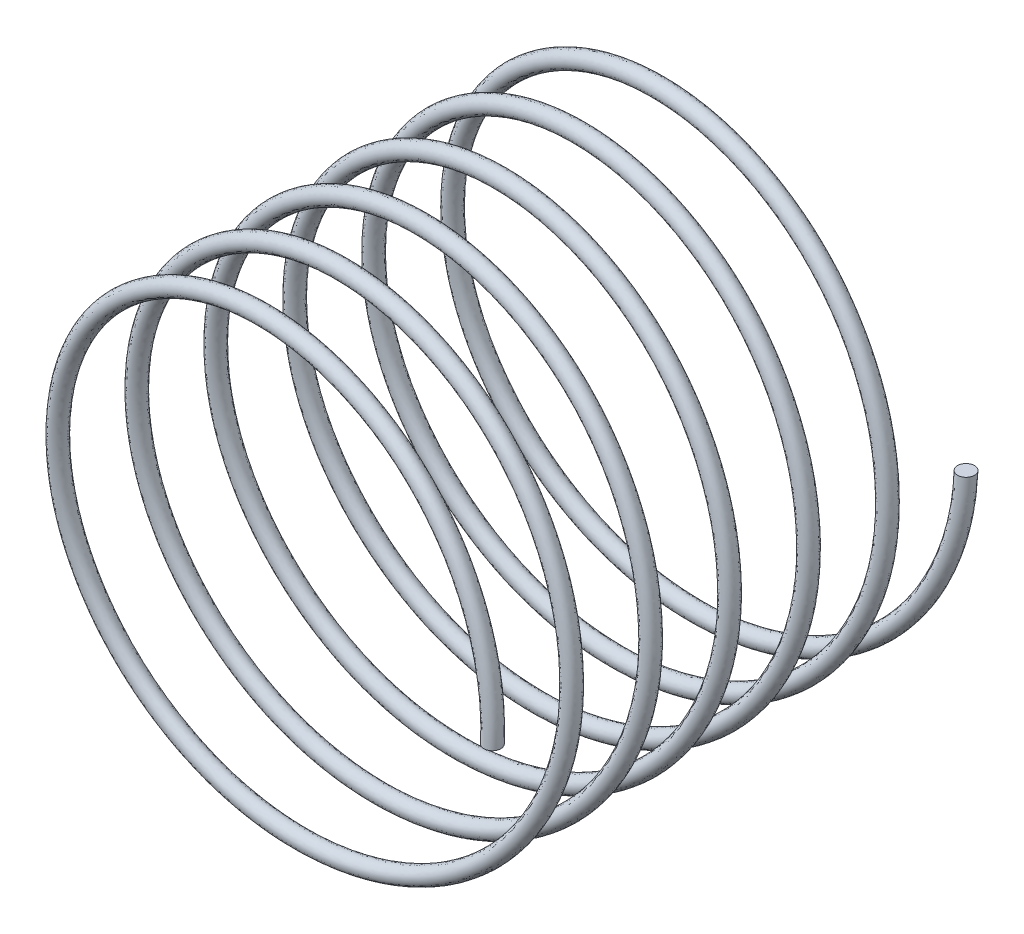
ISO-10303-21;
HEADER;
FILE_DESCRIPTION(('STEP AP214'),'2;1');
FILE_NAME('part.step','',(''),(''),'','','');
FILE_SCHEMA(('AUTOMOTIVE_DESIGN { 1 0 10303 214 1 1 1 1 }'));
ENDSEC;
DATA;
#1=APPLICATION_CONTEXT('core data for automotive mechanical design processes');
#2=APPLICATION_PROTOCOL_DEFINITION('international standard','automotive_design',2000,#1);
#3=PRODUCT_CONTEXT('',#1,'mechanical');
#4=PRODUCT('Part','Part','',(#3));
#5=PRODUCT_RELATED_PRODUCT_CATEGORY('part','',(#4));
#6=PRODUCT_DEFINITION_FORMATION('','',#4);
#7=PRODUCT_DEFINITION_CONTEXT('part definition',#1,'design');
#8=PRODUCT_DEFINITION('design','',#6,#7);
#9=PRODUCT_DEFINITION_SHAPE('','',#8);
#10=(LENGTH_UNIT() NAMED_UNIT(*) SI_UNIT(.MILLI.,.METRE.));
#11=(NAMED_UNIT(*) PLANE_ANGLE_UNIT() SI_UNIT($,.RADIAN.));
#12=(NAMED_UNIT(*) SI_UNIT($,.STERADIAN.) SOLID_ANGLE_UNIT());
#13=UNCERTAINTY_MEASURE_WITH_UNIT(LENGTH_MEASURE(1.E-05),#10,'distance_accuracy_value','');
#14=(GEOMETRIC_REPRESENTATION_CONTEXT(3) GLOBAL_UNCERTAINTY_ASSIGNED_CONTEXT((#13)) GLOBAL_UNIT_ASSIGNED_CONTEXT((#10,
#11,#12)) REPRESENTATION_CONTEXT('',''));
#15=CARTESIAN_POINT('',(0.,0.,0.));
#16=DIRECTION('',(0.,0.,1.));
#17=DIRECTION('',(1.,0.,0.));
#18=AXIS2_PLACEMENT_3D('',#15,#16,#17);
#19=CARTESIAN_POINT('',(2.8,0.,0.));
#20=DIRECTION('',(0.,1.,0.));
#21=DIRECTION('',(0.,0.,1.));
#22=AXIS2_PLACEMENT_3D('',#19,#20,#21);
#23=PLANE('',#22);
#24=CARTESIAN_POINT('',(2.8,0.,0.));
#25=DIRECTION('',(0.,1.,0.));
#26=DIRECTION('',(0.,0.,1.));
#27=AXIS2_PLACEMENT_3D('',#24,#25,#26);
#28=CIRCLE('',#27,0.0999999999999999);
#29=CARTESIAN_POINT('',(2.8,0.,0.0999999999999999));
#30=VERTEX_POINT('',#29);
#31=EDGE_CURVE('E43',#30,#30,#28,.T.);
#32=ORIENTED_EDGE('',*,*,#31,.T.);
#33=EDGE_LOOP('',(#32));
#34=FACE_BOUND('',#33,.T.);
#35=ADVANCED_FACE('F36',(#34),#23,.T.);
#36=CARTESIAN_POINT('',(2.8,-2.14732485265268E-13,5.6));
#37=DIRECTION('',(0.,1.,0.));
#38=DIRECTION('',(0.,0.,1.));
#39=AXIS2_PLACEMENT_3D('',#36,#37,#38);
#40=PLANE('',#39);
#41=CARTESIAN_POINT('',(2.8,-2.14732485265268E-13,5.6));
#42=DIRECTION('',(0.,1.,0.));
#43=DIRECTION('',(0.,0.,1.));
#44=AXIS2_PLACEMENT_3D('',#41,#42,#43);
#45=CIRCLE('',#44,0.0999999999999999);
#46=CARTESIAN_POINT('',(2.8,-2.14732485265268E-13,5.7));
#47=VERTEX_POINT('',#46);
#48=EDGE_CURVE('E11',#47,#47,#45,.T.);
#49=ORIENTED_EDGE('',*,*,#48,.F.);
#50=EDGE_LOOP('',(#49));
#51=FACE_BOUND('',#50,.T.);
#52=ADVANCED_FACE('F52',(#51),#40,.F.);
#53=CARTESIAN_POINT('',(2.8,0.,0.0999999999999999));
#54=CARTESIAN_POINT('',(2.8,-1.61658075373095,0.177777777777777));
#55=CARTESIAN_POINT('',(1.4,-2.42487113059643,0.255555555555555));
#56=CARTESIAN_POINT('',(0.,-3.2331615074619,0.333333333333333));
#57=CARTESIAN_POINT('',(-1.4,-2.42487113059643,0.41111111111111));
#58=CARTESIAN_POINT('',(-2.8,-1.61658075373095,0.488888888888888));
#59=CARTESIAN_POINT('',(-2.8,0.,0.566666666666666));
#60=CARTESIAN_POINT('',(-2.8,1.61658075373095,0.644444444444443));
#61=CARTESIAN_POINT('',(-1.4,2.42487113059643,0.722222222222221));
#62=CARTESIAN_POINT('',(0.,3.2331615074619,0.799999999999998));
#63=CARTESIAN_POINT('',(1.4,2.42487113059643,0.877777777777776));
#64=CARTESIAN_POINT('',(2.8,1.61658075373095,0.955555555555554));
#65=CARTESIAN_POINT('',(2.8,0.,1.03333333333333));
#66=CARTESIAN_POINT('',(2.8,-1.61658075373095,1.11111111111111));
#67=CARTESIAN_POINT('',(1.4,-2.42487113059643,1.18888888888889));
#68=CARTESIAN_POINT('',(0.,-3.2331615074619,1.26666666666666));
#69=CARTESIAN_POINT('',(-1.4,-2.42487113059643,1.34444444444444));
#70=CARTESIAN_POINT('',(-2.8,-1.61658075373095,1.42222222222222));
#71=CARTESIAN_POINT('',(-2.8,0.,1.5));
#72=CARTESIAN_POINT('',(-2.8,1.61658075373095,1.57777777777777));
#73=CARTESIAN_POINT('',(-1.4,2.42487113059643,1.65555555555555));
#74=CARTESIAN_POINT('',(0.,3.2331615074619,1.73333333333333));
#75=CARTESIAN_POINT('',(1.4,2.42487113059643,1.81111111111111));
#76=CARTESIAN_POINT('',(2.8,1.61658075373095,1.88888888888889));
#77=CARTESIAN_POINT('',(2.8,0.,1.96666666666666));
#78=CARTESIAN_POINT('',(2.8,-1.61658075373095,2.04444444444444));
#79=CARTESIAN_POINT('',(1.4,-2.42487113059643,2.12222222222222));
#80=CARTESIAN_POINT('',(0.,-3.2331615074619,2.2));
#81=CARTESIAN_POINT('',(-1.4,-2.42487113059643,2.27777777777777));
#82=CARTESIAN_POINT('',(-2.8,-1.61658075373095,2.35555555555555));
#83=CARTESIAN_POINT('',(-2.8,0.,2.43333333333333));
#84=CARTESIAN_POINT('',(-2.8,1.61658075373095,2.51111111111111));
#85=CARTESIAN_POINT('',(-1.4,2.42487113059643,2.58888888888888));
#86=CARTESIAN_POINT('',(0.,3.2331615074619,2.66666666666666));
#87=CARTESIAN_POINT('',(1.4,2.42487113059643,2.74444444444444));
#88=CARTESIAN_POINT('',(2.8,1.61658075373095,2.82222222222222));
#89=CARTESIAN_POINT('',(2.8,0.,2.89999999999999));
#90=CARTESIAN_POINT('',(2.8,-1.61658075373095,2.97777777777777));
#91=CARTESIAN_POINT('',(1.4,-2.42487113059643,3.05555555555555));
#92=CARTESIAN_POINT('',(0.,-3.2331615074619,3.13333333333333));
#93=CARTESIAN_POINT('',(-1.4,-2.42487113059643,3.2111111111111));
#94=CARTESIAN_POINT('',(-2.8,-1.61658075373095,3.28888888888888));
#95=CARTESIAN_POINT('',(-2.8,0.,3.36666666666666));
#96=CARTESIAN_POINT('',(-2.8,1.61658075373095,3.44444444444444));
#97=CARTESIAN_POINT('',(-1.4,2.42487113059643,3.52222222222222));
#98=CARTESIAN_POINT('',(0.,3.2331615074619,3.59999999999999));
#99=CARTESIAN_POINT('',(1.4,2.42487113059643,3.67777777777777));
#100=CARTESIAN_POINT('',(2.8,1.61658075373095,3.75555555555555));
#101=CARTESIAN_POINT('',(2.8,0.,3.83333333333333));
#102=CARTESIAN_POINT('',(2.8,-1.61658075373095,3.9111111111111));
#103=CARTESIAN_POINT('',(1.4,-2.42487113059643,3.98888888888888));
#104=CARTESIAN_POINT('',(0.,-3.2331615074619,4.06666666666666));
#105=CARTESIAN_POINT('',(-1.4,-2.42487113059643,4.14444444444444));
#106=CARTESIAN_POINT('',(-2.8,-1.61658075373095,4.22222222222221));
#107=CARTESIAN_POINT('',(-2.8,0.,4.29999999999999));
#108=CARTESIAN_POINT('',(-2.8,1.61658075373095,4.37777777777777));
#109=CARTESIAN_POINT('',(-1.4,2.42487113059643,4.45555555555555));
#110=CARTESIAN_POINT('',(0.,3.2331615074619,4.53333333333332));
#111=CARTESIAN_POINT('',(1.4,2.42487113059643,4.6111111111111));
#112=CARTESIAN_POINT('',(2.8,1.61658075373095,4.68888888888888));
#113=CARTESIAN_POINT('',(2.8,0.,4.76666666666666));
#114=CARTESIAN_POINT('',(2.8,-1.61658075373095,4.84444444444444));
#115=CARTESIAN_POINT('',(1.4,-2.42487113059643,4.92222222222221));
#116=CARTESIAN_POINT('',(0.,-3.2331615074619,4.99999999999999));
#117=CARTESIAN_POINT('',(-1.4,-2.42487113059643,5.07777777777777));
#118=CARTESIAN_POINT('',(-2.8,-1.61658075373095,5.15555555555555));
#119=CARTESIAN_POINT('',(-2.8,0.,5.23333333333332));
#120=CARTESIAN_POINT('',(-2.8,1.61658075373095,5.3111111111111));
#121=CARTESIAN_POINT('',(-1.4,2.42487113059643,5.38888888888888));
#122=CARTESIAN_POINT('',(0.,3.2331615074619,5.46666666666666));
#123=CARTESIAN_POINT('',(1.4,2.42487113059643,5.54444444444443));
#124=CARTESIAN_POINT('',(2.8,1.61658075373095,5.62222222222221));
#125=CARTESIAN_POINT('',(2.8,0.,5.69999999999999));
#126=CARTESIAN_POINT('',(3.,0.,0.0999999999999999));
#127=CARTESIAN_POINT('',(3.,-1.73205080756888,0.177777777777778));
#128=CARTESIAN_POINT('',(1.5,-2.59807621135332,0.255555555555555));
#129=CARTESIAN_POINT('',(0.,-3.46410161513775,0.333333333333333));
#130=CARTESIAN_POINT('',(-1.5,-2.59807621135332,0.41111111111111));
#131=CARTESIAN_POINT('',(-3.,-1.73205080756888,0.488888888888888));
#132=CARTESIAN_POINT('',(-3.,0.,0.566666666666666));
#133=CARTESIAN_POINT('',(-3.,1.73205080756888,0.644444444444443));
#134=CARTESIAN_POINT('',(-1.5,2.59807621135332,0.722222222222221));
#135=CARTESIAN_POINT('',(0.,3.46410161513775,0.799999999999998));
#136=CARTESIAN_POINT('',(1.5,2.59807621135332,0.877777777777776));
#137=CARTESIAN_POINT('',(3.,1.73205080756888,0.955555555555554));
#138=CARTESIAN_POINT('',(3.,0.,1.03333333333333));
#139=CARTESIAN_POINT('',(3.,-1.73205080756888,1.11111111111111));
#140=CARTESIAN_POINT('',(1.5,-2.59807621135332,1.18888888888889));
#141=CARTESIAN_POINT('',(0.,-3.46410161513775,1.26666666666666));
#142=CARTESIAN_POINT('',(-1.5,-2.59807621135332,1.34444444444444));
#143=CARTESIAN_POINT('',(-3.,-1.73205080756888,1.42222222222222));
#144=CARTESIAN_POINT('',(-3.,0.,1.5));
#145=CARTESIAN_POINT('',(-3.,1.73205080756888,1.57777777777777));
#146=CARTESIAN_POINT('',(-1.5,2.59807621135332,1.65555555555555));
#147=CARTESIAN_POINT('',(0.,3.46410161513775,1.73333333333333));
#148=CARTESIAN_POINT('',(1.5,2.59807621135332,1.81111111111111));
#149=CARTESIAN_POINT('',(3.,1.73205080756888,1.88888888888889));
#150=CARTESIAN_POINT('',(3.,0.,1.96666666666666));
#151=CARTESIAN_POINT('',(3.,-1.73205080756888,2.04444444444444));
#152=CARTESIAN_POINT('',(1.5,-2.59807621135332,2.12222222222222));
#153=CARTESIAN_POINT('',(0.,-3.46410161513775,2.2));
#154=CARTESIAN_POINT('',(-1.5,-2.59807621135332,2.27777777777777));
#155=CARTESIAN_POINT('',(-3.,-1.73205080756888,2.35555555555555));
#156=CARTESIAN_POINT('',(-3.,0.,2.43333333333333));
#157=CARTESIAN_POINT('',(-3.,1.73205080756888,2.51111111111111));
#158=CARTESIAN_POINT('',(-1.5,2.59807621135332,2.58888888888888));
#159=CARTESIAN_POINT('',(0.,3.46410161513775,2.66666666666666));
#160=CARTESIAN_POINT('',(1.5,2.59807621135332,2.74444444444444));
#161=CARTESIAN_POINT('',(3.,1.73205080756888,2.82222222222222));
#162=CARTESIAN_POINT('',(3.,0.,2.89999999999999));
#163=CARTESIAN_POINT('',(3.,-1.73205080756888,2.97777777777777));
#164=CARTESIAN_POINT('',(1.5,-2.59807621135332,3.05555555555555));
#165=CARTESIAN_POINT('',(0.,-3.46410161513775,3.13333333333333));
#166=CARTESIAN_POINT('',(-1.5,-2.59807621135332,3.21111111111111));
#167=CARTESIAN_POINT('',(-3.,-1.73205080756888,3.28888888888888));
#168=CARTESIAN_POINT('',(-3.,0.,3.36666666666666));
#169=CARTESIAN_POINT('',(-3.,1.73205080756888,3.44444444444444));
#170=CARTESIAN_POINT('',(-1.5,2.59807621135332,3.52222222222222));
#171=CARTESIAN_POINT('',(0.,3.46410161513775,3.59999999999999));
#172=CARTESIAN_POINT('',(1.5,2.59807621135332,3.67777777777777));
#173=CARTESIAN_POINT('',(3.,1.73205080756888,3.75555555555555));
#174=CARTESIAN_POINT('',(3.,0.,3.83333333333333));
#175=CARTESIAN_POINT('',(3.,-1.73205080756888,3.9111111111111));
#176=CARTESIAN_POINT('',(1.5,-2.59807621135332,3.98888888888888));
#177=CARTESIAN_POINT('',(0.,-3.46410161513775,4.06666666666666));
#178=CARTESIAN_POINT('',(-1.5,-2.59807621135332,4.14444444444444));
#179=CARTESIAN_POINT('',(-3.,-1.73205080756888,4.22222222222221));
#180=CARTESIAN_POINT('',(-3.,0.,4.29999999999999));
#181=CARTESIAN_POINT('',(-3.,1.73205080756888,4.37777777777777));
#182=CARTESIAN_POINT('',(-1.5,2.59807621135332,4.45555555555555));
#183=CARTESIAN_POINT('',(0.,3.46410161513775,4.53333333333332));
#184=CARTESIAN_POINT('',(1.5,2.59807621135332,4.6111111111111));
#185=CARTESIAN_POINT('',(3.,1.73205080756888,4.68888888888888));
#186=CARTESIAN_POINT('',(3.,0.,4.76666666666666));
#187=CARTESIAN_POINT('',(3.,-1.73205080756888,4.84444444444444));
#188=CARTESIAN_POINT('',(1.5,-2.59807621135332,4.92222222222221));
#189=CARTESIAN_POINT('',(0.,-3.46410161513775,4.99999999999999));
#190=CARTESIAN_POINT('',(-1.5,-2.59807621135332,5.07777777777777));
#191=CARTESIAN_POINT('',(-3.,-1.73205080756888,5.15555555555555));
#192=CARTESIAN_POINT('',(-3.,0.,5.23333333333332));
#193=CARTESIAN_POINT('',(-3.,1.73205080756888,5.3111111111111));
#194=CARTESIAN_POINT('',(-1.5,2.59807621135332,5.38888888888888));
#195=CARTESIAN_POINT('',(0.,3.46410161513775,5.46666666666666));
#196=CARTESIAN_POINT('',(1.5,2.59807621135332,5.54444444444443));
#197=CARTESIAN_POINT('',(3.,1.73205080756888,5.62222222222221));
#198=CARTESIAN_POINT('',(3.,0.,5.69999999999999));
#199=CARTESIAN_POINT('',(3.,0.,-0.0999999999999999));
#200=CARTESIAN_POINT('',(3.,-1.73205080756888,-0.0222222222222222));
#201=CARTESIAN_POINT('',(1.5,-2.59807621135332,0.0555555555555554));
#202=CARTESIAN_POINT('',(0.,-3.46410161513775,0.133333333333333));
#203=CARTESIAN_POINT('',(-1.5,-2.59807621135332,0.211111111111111));
#204=CARTESIAN_POINT('',(-3.,-1.73205080756888,0.288888888888888));
#205=CARTESIAN_POINT('',(-3.,0.,0.366666666666666));
#206=CARTESIAN_POINT('',(-3.,1.73205080756888,0.444444444444443));
#207=CARTESIAN_POINT('',(-1.5,2.59807621135332,0.522222222222221));
#208=CARTESIAN_POINT('',(0.,3.46410161513775,0.599999999999999));
#209=CARTESIAN_POINT('',(1.5,2.59807621135332,0.677777777777776));
#210=CARTESIAN_POINT('',(3.,1.73205080756888,0.755555555555554));
#211=CARTESIAN_POINT('',(3.,0.,0.833333333333332));
#212=CARTESIAN_POINT('',(3.,-1.73205080756888,0.911111111111109));
#213=CARTESIAN_POINT('',(1.5,-2.59807621135332,0.988888888888887));
#214=CARTESIAN_POINT('',(0.,-3.46410161513775,1.06666666666666));
#215=CARTESIAN_POINT('',(-1.5,-2.59807621135332,1.14444444444444));
#216=CARTESIAN_POINT('',(-3.,-1.73205080756888,1.22222222222222));
#217=CARTESIAN_POINT('',(-3.,0.,1.3));
#218=CARTESIAN_POINT('',(-3.,1.73205080756888,1.37777777777777));
#219=CARTESIAN_POINT('',(-1.5,2.59807621135332,1.45555555555555));
#220=CARTESIAN_POINT('',(0.,3.46410161513775,1.53333333333333));
#221=CARTESIAN_POINT('',(1.5,2.59807621135332,1.61111111111111));
#222=CARTESIAN_POINT('',(3.,1.73205080756888,1.68888888888889));
#223=CARTESIAN_POINT('',(3.,0.,1.76666666666666));
#224=CARTESIAN_POINT('',(3.,-1.73205080756888,1.84444444444444));
#225=CARTESIAN_POINT('',(1.5,-2.59807621135332,1.92222222222222));
#226=CARTESIAN_POINT('',(0.,-3.46410161513775,2.));
#227=CARTESIAN_POINT('',(-1.5,-2.59807621135332,2.07777777777777));
#228=CARTESIAN_POINT('',(-3.,-1.73205080756888,2.15555555555555));
#229=CARTESIAN_POINT('',(-3.,0.,2.23333333333333));
#230=CARTESIAN_POINT('',(-3.,1.73205080756888,2.31111111111111));
#231=CARTESIAN_POINT('',(-1.5,2.59807621135332,2.38888888888888));
#232=CARTESIAN_POINT('',(0.,3.46410161513775,2.46666666666666));
#233=CARTESIAN_POINT('',(1.5,2.59807621135332,2.54444444444444));
#234=CARTESIAN_POINT('',(3.,1.73205080756888,2.62222222222222));
#235=CARTESIAN_POINT('',(3.,0.,2.69999999999999));
#236=CARTESIAN_POINT('',(3.,-1.73205080756888,2.77777777777777));
#237=CARTESIAN_POINT('',(1.5,-2.59807621135332,2.85555555555555));
#238=CARTESIAN_POINT('',(0.,-3.46410161513775,2.93333333333333));
#239=CARTESIAN_POINT('',(-1.5,-2.59807621135332,3.0111111111111));
#240=CARTESIAN_POINT('',(-3.,-1.73205080756888,3.08888888888888));
#241=CARTESIAN_POINT('',(-3.,0.,3.16666666666666));
#242=CARTESIAN_POINT('',(-3.,1.73205080756888,3.24444444444444));
#243=CARTESIAN_POINT('',(-1.5,2.59807621135332,3.32222222222222));
#244=CARTESIAN_POINT('',(0.,3.46410161513775,3.39999999999999));
#245=CARTESIAN_POINT('',(1.5,2.59807621135332,3.47777777777777));
#246=CARTESIAN_POINT('',(3.,1.73205080756888,3.55555555555555));
#247=CARTESIAN_POINT('',(3.,0.,3.63333333333333));
#248=CARTESIAN_POINT('',(3.,-1.73205080756888,3.7111111111111));
#249=CARTESIAN_POINT('',(1.5,-2.59807621135332,3.78888888888888));
#250=CARTESIAN_POINT('',(0.,-3.46410161513775,3.86666666666666));
#251=CARTESIAN_POINT('',(-1.5,-2.59807621135332,3.94444444444444));
#252=CARTESIAN_POINT('',(-3.,-1.73205080756888,4.02222222222221));
#253=CARTESIAN_POINT('',(-3.,0.,4.09999999999999));
#254=CARTESIAN_POINT('',(-3.,1.73205080756888,4.17777777777777));
#255=CARTESIAN_POINT('',(-1.5,2.59807621135332,4.25555555555555));
#256=CARTESIAN_POINT('',(0.,3.46410161513775,4.33333333333332));
#257=CARTESIAN_POINT('',(1.5,2.59807621135332,4.4111111111111));
#258=CARTESIAN_POINT('',(3.,1.73205080756888,4.48888888888888));
#259=CARTESIAN_POINT('',(3.,0.,4.56666666666666));
#260=CARTESIAN_POINT('',(3.,-1.73205080756888,4.64444444444443));
#261=CARTESIAN_POINT('',(1.5,-2.59807621135332,4.72222222222221));
#262=CARTESIAN_POINT('',(0.,-3.46410161513775,4.79999999999999));
#263=CARTESIAN_POINT('',(-1.5,-2.59807621135332,4.87777777777777));
#264=CARTESIAN_POINT('',(-3.,-1.73205080756888,4.95555555555555));
#265=CARTESIAN_POINT('',(-3.,0.,5.03333333333332));
#266=CARTESIAN_POINT('',(-3.,1.73205080756888,5.1111111111111));
#267=CARTESIAN_POINT('',(-1.5,2.59807621135332,5.18888888888888));
#268=CARTESIAN_POINT('',(0.,3.46410161513775,5.26666666666666));
#269=CARTESIAN_POINT('',(1.5,2.59807621135332,5.34444444444443));
#270=CARTESIAN_POINT('',(3.,1.73205080756888,5.42222222222221));
#271=CARTESIAN_POINT('',(3.,0.,5.49999999999999));
#272=CARTESIAN_POINT('',(2.8,0.,-0.0999999999999999));
#273=CARTESIAN_POINT('',(2.8,-1.61658075373095,-0.0222222222222223));
#274=CARTESIAN_POINT('',(1.4,-2.42487113059643,0.0555555555555554));
#275=CARTESIAN_POINT('',(0.,-3.2331615074619,0.133333333333333));
#276=CARTESIAN_POINT('',(-1.4,-2.42487113059643,0.211111111111111));
#277=CARTESIAN_POINT('',(-2.8,-1.61658075373095,0.288888888888888));
#278=CARTESIAN_POINT('',(-2.8,0.,0.366666666666666));
#279=CARTESIAN_POINT('',(-2.8,1.61658075373095,0.444444444444443));
#280=CARTESIAN_POINT('',(-1.4,2.42487113059643,0.522222222222221));
#281=CARTESIAN_POINT('',(0.,3.2331615074619,0.599999999999999));
#282=CARTESIAN_POINT('',(1.4,2.42487113059643,0.677777777777776));
#283=CARTESIAN_POINT('',(2.8,1.61658075373095,0.755555555555554));
#284=CARTESIAN_POINT('',(2.8,0.,0.833333333333332));
#285=CARTESIAN_POINT('',(2.8,-1.61658075373095,0.911111111111109));
#286=CARTESIAN_POINT('',(1.4,-2.42487113059643,0.988888888888887));
#287=CARTESIAN_POINT('',(0.,-3.2331615074619,1.06666666666666));
#288=CARTESIAN_POINT('',(-1.4,-2.42487113059643,1.14444444444444));
#289=CARTESIAN_POINT('',(-2.8,-1.61658075373095,1.22222222222222));
#290=CARTESIAN_POINT('',(-2.8,0.,1.3));
#291=CARTESIAN_POINT('',(-2.8,1.61658075373095,1.37777777777777));
#292=CARTESIAN_POINT('',(-1.4,2.42487113059643,1.45555555555555));
#293=CARTESIAN_POINT('',(0.,3.2331615074619,1.53333333333333));
#294=CARTESIAN_POINT('',(1.4,2.42487113059643,1.61111111111111));
#295=CARTESIAN_POINT('',(2.8,1.61658075373095,1.68888888888889));
#296=CARTESIAN_POINT('',(2.8,0.,1.76666666666666));
#297=CARTESIAN_POINT('',(2.8,-1.61658075373095,1.84444444444444));
#298=CARTESIAN_POINT('',(1.4,-2.42487113059643,1.92222222222222));
#299=CARTESIAN_POINT('',(0.,-3.2331615074619,2.));
#300=CARTESIAN_POINT('',(-1.4,-2.42487113059643,2.07777777777777));
#301=CARTESIAN_POINT('',(-2.8,-1.61658075373095,2.15555555555555));
#302=CARTESIAN_POINT('',(-2.8,0.,2.23333333333333));
#303=CARTESIAN_POINT('',(-2.8,1.61658075373095,2.31111111111111));
#304=CARTESIAN_POINT('',(-1.4,2.42487113059643,2.38888888888888));
#305=CARTESIAN_POINT('',(0.,3.2331615074619,2.46666666666666));
#306=CARTESIAN_POINT('',(1.4,2.42487113059643,2.54444444444444));
#307=CARTESIAN_POINT('',(2.8,1.61658075373095,2.62222222222222));
#308=CARTESIAN_POINT('',(2.8,0.,2.69999999999999));
#309=CARTESIAN_POINT('',(2.8,-1.61658075373095,2.77777777777777));
#310=CARTESIAN_POINT('',(1.4,-2.42487113059643,2.85555555555555));
#311=CARTESIAN_POINT('',(0.,-3.2331615074619,2.93333333333333));
#312=CARTESIAN_POINT('',(-1.4,-2.42487113059643,3.0111111111111));
#313=CARTESIAN_POINT('',(-2.8,-1.61658075373095,3.08888888888888));
#314=CARTESIAN_POINT('',(-2.8,0.,3.16666666666666));
#315=CARTESIAN_POINT('',(-2.8,1.61658075373095,3.24444444444444));
#316=CARTESIAN_POINT('',(-1.4,2.42487113059643,3.32222222222222));
#317=CARTESIAN_POINT('',(0.,3.2331615074619,3.39999999999999));
#318=CARTESIAN_POINT('',(1.4,2.42487113059643,3.47777777777777));
#319=CARTESIAN_POINT('',(2.8,1.61658075373095,3.55555555555555));
#320=CARTESIAN_POINT('',(2.8,0.,3.63333333333333));
#321=CARTESIAN_POINT('',(2.8,-1.61658075373095,3.7111111111111));
#322=CARTESIAN_POINT('',(1.4,-2.42487113059643,3.78888888888888));
#323=CARTESIAN_POINT('',(0.,-3.2331615074619,3.86666666666666));
#324=CARTESIAN_POINT('',(-1.4,-2.42487113059643,3.94444444444444));
#325=CARTESIAN_POINT('',(-2.8,-1.61658075373095,4.02222222222221));
#326=CARTESIAN_POINT('',(-2.8,0.,4.09999999999999));
#327=CARTESIAN_POINT('',(-2.8,1.61658075373095,4.17777777777777));
#328=CARTESIAN_POINT('',(-1.4,2.42487113059643,4.25555555555555));
#329=CARTESIAN_POINT('',(0.,3.2331615074619,4.33333333333332));
#330=CARTESIAN_POINT('',(1.4,2.42487113059643,4.4111111111111));
#331=CARTESIAN_POINT('',(2.8,1.61658075373095,4.48888888888888));
#332=CARTESIAN_POINT('',(2.8,0.,4.56666666666666));
#333=CARTESIAN_POINT('',(2.8,-1.61658075373095,4.64444444444443));
#334=CARTESIAN_POINT('',(1.4,-2.42487113059643,4.72222222222221));
#335=CARTESIAN_POINT('',(0.,-3.2331615074619,4.79999999999999));
#336=CARTESIAN_POINT('',(-1.4,-2.42487113059643,4.87777777777777));
#337=CARTESIAN_POINT('',(-2.8,-1.61658075373095,4.95555555555555));
#338=CARTESIAN_POINT('',(-2.8,0.,5.03333333333332));
#339=CARTESIAN_POINT('',(-2.8,1.61658075373095,5.1111111111111));
#340=CARTESIAN_POINT('',(-1.4,2.42487113059643,5.18888888888888));
#341=CARTESIAN_POINT('',(0.,3.2331615074619,5.26666666666666));
#342=CARTESIAN_POINT('',(1.4,2.42487113059643,5.34444444444443));
#343=CARTESIAN_POINT('',(2.8,1.61658075373095,5.42222222222221));
#344=CARTESIAN_POINT('',(2.8,0.,5.49999999999999));
#345=CARTESIAN_POINT('',(2.6,0.,-0.0999999999999999));
#346=CARTESIAN_POINT('',(2.6,-1.50111069989303,-0.0222222222222223));
#347=CARTESIAN_POINT('',(1.3,-2.25166604983954,0.0555555555555553));
#348=CARTESIAN_POINT('',(0.,-3.00222139978605,0.133333333333333));
#349=CARTESIAN_POINT('',(-1.3,-2.25166604983954,0.211111111111111));
#350=CARTESIAN_POINT('',(-2.6,-1.50111069989303,0.288888888888888));
#351=CARTESIAN_POINT('',(-2.6,0.,0.366666666666666));
#352=CARTESIAN_POINT('',(-2.6,1.50111069989303,0.444444444444443));
#353=CARTESIAN_POINT('',(-1.3,2.25166604983954,0.522222222222221));
#354=CARTESIAN_POINT('',(0.,3.00222139978605,0.599999999999999));
#355=CARTESIAN_POINT('',(1.3,2.25166604983954,0.677777777777776));
#356=CARTESIAN_POINT('',(2.6,1.50111069989303,0.755555555555554));
#357=CARTESIAN_POINT('',(2.6,0.,0.833333333333331));
#358=CARTESIAN_POINT('',(2.6,-1.50111069989303,0.911111111111109));
#359=CARTESIAN_POINT('',(1.3,-2.25166604983954,0.988888888888887));
#360=CARTESIAN_POINT('',(0.,-3.00222139978605,1.06666666666666));
#361=CARTESIAN_POINT('',(-1.3,-2.25166604983954,1.14444444444444));
#362=CARTESIAN_POINT('',(-2.6,-1.50111069989303,1.22222222222222));
#363=CARTESIAN_POINT('',(-2.6,0.,1.3));
#364=CARTESIAN_POINT('',(-2.6,1.50111069989303,1.37777777777777));
#365=CARTESIAN_POINT('',(-1.3,2.25166604983954,1.45555555555555));
#366=CARTESIAN_POINT('',(0.,3.00222139978605,1.53333333333333));
#367=CARTESIAN_POINT('',(1.3,2.25166604983954,1.61111111111111));
#368=CARTESIAN_POINT('',(2.6,1.50111069989303,1.68888888888889));
#369=CARTESIAN_POINT('',(2.6,0.,1.76666666666666));
#370=CARTESIAN_POINT('',(2.6,-1.50111069989303,1.84444444444444));
#371=CARTESIAN_POINT('',(1.3,-2.25166604983954,1.92222222222222));
#372=CARTESIAN_POINT('',(0.,-3.00222139978605,2.));
#373=CARTESIAN_POINT('',(-1.3,-2.25166604983954,2.07777777777777));
#374=CARTESIAN_POINT('',(-2.6,-1.50111069989303,2.15555555555555));
#375=CARTESIAN_POINT('',(-2.6,0.,2.23333333333333));
#376=CARTESIAN_POINT('',(-2.6,1.50111069989303,2.31111111111111));
#377=CARTESIAN_POINT('',(-1.3,2.25166604983954,2.38888888888888));
#378=CARTESIAN_POINT('',(0.,3.00222139978605,2.46666666666666));
#379=CARTESIAN_POINT('',(1.3,2.25166604983954,2.54444444444444));
#380=CARTESIAN_POINT('',(2.6,1.50111069989303,2.62222222222222));
#381=CARTESIAN_POINT('',(2.6,0.,2.69999999999999));
#382=CARTESIAN_POINT('',(2.6,-1.50111069989303,2.77777777777777));
#383=CARTESIAN_POINT('',(1.3,-2.25166604983954,2.85555555555555));
#384=CARTESIAN_POINT('',(0.,-3.00222139978605,2.93333333333333));
#385=CARTESIAN_POINT('',(-1.3,-2.25166604983954,3.0111111111111));
#386=CARTESIAN_POINT('',(-2.6,-1.50111069989303,3.08888888888888));
#387=CARTESIAN_POINT('',(-2.6,0.,3.16666666666666));
#388=CARTESIAN_POINT('',(-2.6,1.50111069989303,3.24444444444444));
#389=CARTESIAN_POINT('',(-1.3,2.25166604983954,3.32222222222222));
#390=CARTESIAN_POINT('',(0.,3.00222139978605,3.39999999999999));
#391=CARTESIAN_POINT('',(1.3,2.25166604983954,3.47777777777777));
#392=CARTESIAN_POINT('',(2.6,1.50111069989303,3.55555555555555));
#393=CARTESIAN_POINT('',(2.6,0.,3.63333333333333));
#394=CARTESIAN_POINT('',(2.6,-1.50111069989303,3.7111111111111));
#395=CARTESIAN_POINT('',(1.3,-2.25166604983954,3.78888888888888));
#396=CARTESIAN_POINT('',(0.,-3.00222139978605,3.86666666666666));
#397=CARTESIAN_POINT('',(-1.3,-2.25166604983954,3.94444444444444));
#398=CARTESIAN_POINT('',(-2.6,-1.50111069989303,4.02222222222221));
#399=CARTESIAN_POINT('',(-2.6,0.,4.09999999999999));
#400=CARTESIAN_POINT('',(-2.6,1.50111069989303,4.17777777777777));
#401=CARTESIAN_POINT('',(-1.3,2.25166604983954,4.25555555555555));
#402=CARTESIAN_POINT('',(0.,3.00222139978605,4.33333333333332));
#403=CARTESIAN_POINT('',(1.3,2.25166604983954,4.4111111111111));
#404=CARTESIAN_POINT('',(2.6,1.50111069989303,4.48888888888888));
#405=CARTESIAN_POINT('',(2.6,0.,4.56666666666666));
#406=CARTESIAN_POINT('',(2.6,-1.50111069989303,4.64444444444443));
#407=CARTESIAN_POINT('',(1.3,-2.25166604983954,4.72222222222221));
#408=CARTESIAN_POINT('',(0.,-3.00222139978605,4.79999999999999));
#409=CARTESIAN_POINT('',(-1.3,-2.25166604983954,4.87777777777777));
#410=CARTESIAN_POINT('',(-2.6,-1.50111069989303,4.95555555555555));
#411=CARTESIAN_POINT('',(-2.6,0.,5.03333333333332));
#412=CARTESIAN_POINT('',(-2.6,1.50111069989303,5.1111111111111));
#413=CARTESIAN_POINT('',(-1.3,2.25166604983954,5.18888888888888));
#414=CARTESIAN_POINT('',(0.,3.00222139978605,5.26666666666666));
#415=CARTESIAN_POINT('',(1.3,2.25166604983954,5.34444444444443));
#416=CARTESIAN_POINT('',(2.6,1.50111069989303,5.42222222222221));
#417=CARTESIAN_POINT('',(2.6,0.,5.49999999999999));
#418=CARTESIAN_POINT('',(2.6,0.,0.0999999999999999));
#419=CARTESIAN_POINT('',(2.6,-1.50111069989303,0.177777777777778));
#420=CARTESIAN_POINT('',(1.3,-2.25166604983954,0.255555555555555));
#421=CARTESIAN_POINT('',(0.,-3.00222139978605,0.333333333333333));
#422=CARTESIAN_POINT('',(-1.3,-2.25166604983954,0.41111111111111));
#423=CARTESIAN_POINT('',(-2.6,-1.50111069989303,0.488888888888888));
#424=CARTESIAN_POINT('',(-2.6,0.,0.566666666666666));
#425=CARTESIAN_POINT('',(-2.6,1.50111069989303,0.644444444444443));
#426=CARTESIAN_POINT('',(-1.3,2.25166604983954,0.722222222222221));
#427=CARTESIAN_POINT('',(0.,3.00222139978605,0.799999999999998));
#428=CARTESIAN_POINT('',(1.3,2.25166604983954,0.877777777777776));
#429=CARTESIAN_POINT('',(2.6,1.50111069989303,0.955555555555554));
#430=CARTESIAN_POINT('',(2.6,0.,1.03333333333333));
#431=CARTESIAN_POINT('',(2.6,-1.50111069989303,1.11111111111111));
#432=CARTESIAN_POINT('',(1.3,-2.25166604983954,1.18888888888889));
#433=CARTESIAN_POINT('',(0.,-3.00222139978605,1.26666666666666));
#434=CARTESIAN_POINT('',(-1.3,-2.25166604983954,1.34444444444444));
#435=CARTESIAN_POINT('',(-2.6,-1.50111069989303,1.42222222222222));
#436=CARTESIAN_POINT('',(-2.6,0.,1.5));
#437=CARTESIAN_POINT('',(-2.6,1.50111069989303,1.57777777777777));
#438=CARTESIAN_POINT('',(-1.3,2.25166604983954,1.65555555555555));
#439=CARTESIAN_POINT('',(0.,3.00222139978605,1.73333333333333));
#440=CARTESIAN_POINT('',(1.3,2.25166604983954,1.81111111111111));
#441=CARTESIAN_POINT('',(2.6,1.50111069989303,1.88888888888889));
#442=CARTESIAN_POINT('',(2.6,0.,1.96666666666666));
#443=CARTESIAN_POINT('',(2.6,-1.50111069989303,2.04444444444444));
#444=CARTESIAN_POINT('',(1.3,-2.25166604983954,2.12222222222222));
#445=CARTESIAN_POINT('',(0.,-3.00222139978605,2.2));
#446=CARTESIAN_POINT('',(-1.3,-2.25166604983954,2.27777777777777));
#447=CARTESIAN_POINT('',(-2.6,-1.50111069989303,2.35555555555555));
#448=CARTESIAN_POINT('',(-2.6,0.,2.43333333333333));
#449=CARTESIAN_POINT('',(-2.6,1.50111069989303,2.51111111111111));
#450=CARTESIAN_POINT('',(-1.3,2.25166604983954,2.58888888888888));
#451=CARTESIAN_POINT('',(0.,3.00222139978605,2.66666666666666));
#452=CARTESIAN_POINT('',(1.3,2.25166604983954,2.74444444444444));
#453=CARTESIAN_POINT('',(2.6,1.50111069989303,2.82222222222222));
#454=CARTESIAN_POINT('',(2.6,0.,2.89999999999999));
#455=CARTESIAN_POINT('',(2.6,-1.50111069989303,2.97777777777777));
#456=CARTESIAN_POINT('',(1.3,-2.25166604983954,3.05555555555555));
#457=CARTESIAN_POINT('',(0.,-3.00222139978605,3.13333333333333));
#458=CARTESIAN_POINT('',(-1.3,-2.25166604983954,3.21111111111111));
#459=CARTESIAN_POINT('',(-2.6,-1.50111069989303,3.28888888888888));
#460=CARTESIAN_POINT('',(-2.6,0.,3.36666666666666));
#461=CARTESIAN_POINT('',(-2.6,1.50111069989303,3.44444444444444));
#462=CARTESIAN_POINT('',(-1.3,2.25166604983954,3.52222222222222));
#463=CARTESIAN_POINT('',(0.,3.00222139978605,3.59999999999999));
#464=CARTESIAN_POINT('',(1.3,2.25166604983954,3.67777777777777));
#465=CARTESIAN_POINT('',(2.6,1.50111069989303,3.75555555555555));
#466=CARTESIAN_POINT('',(2.6,0.,3.83333333333333));
#467=CARTESIAN_POINT('',(2.6,-1.50111069989303,3.9111111111111));
#468=CARTESIAN_POINT('',(1.3,-2.25166604983954,3.98888888888888));
#469=CARTESIAN_POINT('',(0.,-3.00222139978605,4.06666666666666));
#470=CARTESIAN_POINT('',(-1.3,-2.25166604983954,4.14444444444444));
#471=CARTESIAN_POINT('',(-2.6,-1.50111069989303,4.22222222222221));
#472=CARTESIAN_POINT('',(-2.6,0.,4.29999999999999));
#473=CARTESIAN_POINT('',(-2.6,1.50111069989303,4.37777777777777));
#474=CARTESIAN_POINT('',(-1.3,2.25166604983954,4.45555555555555));
#475=CARTESIAN_POINT('',(0.,3.00222139978605,4.53333333333332));
#476=CARTESIAN_POINT('',(1.3,2.25166604983954,4.6111111111111));
#477=CARTESIAN_POINT('',(2.6,1.50111069989303,4.68888888888888));
#478=CARTESIAN_POINT('',(2.6,0.,4.76666666666666));
#479=CARTESIAN_POINT('',(2.6,-1.50111069989303,4.84444444444444));
#480=CARTESIAN_POINT('',(1.3,-2.25166604983954,4.92222222222221));
#481=CARTESIAN_POINT('',(0.,-3.00222139978605,4.99999999999999));
#482=CARTESIAN_POINT('',(-1.3,-2.25166604983954,5.07777777777777));
#483=CARTESIAN_POINT('',(-2.6,-1.50111069989303,5.15555555555555));
#484=CARTESIAN_POINT('',(-2.6,0.,5.23333333333332));
#485=CARTESIAN_POINT('',(-2.6,1.50111069989303,5.3111111111111));
#486=CARTESIAN_POINT('',(-1.3,2.25166604983954,5.38888888888888));
#487=CARTESIAN_POINT('',(0.,3.00222139978605,5.46666666666666));
#488=CARTESIAN_POINT('',(1.3,2.25166604983954,5.54444444444443));
#489=CARTESIAN_POINT('',(2.6,1.50111069989303,5.62222222222221));
#490=CARTESIAN_POINT('',(2.6,0.,5.69999999999999));
#491=CARTESIAN_POINT('',(2.8,0.,0.0999999999999999));
#492=CARTESIAN_POINT('',(2.8,-1.61658075373095,0.177777777777777));
#493=CARTESIAN_POINT('',(1.4,-2.42487113059643,0.255555555555555));
#494=CARTESIAN_POINT('',(0.,-3.2331615074619,0.333333333333333));
#495=CARTESIAN_POINT('',(-1.4,-2.42487113059643,0.41111111111111));
#496=CARTESIAN_POINT('',(-2.8,-1.61658075373095,0.488888888888888));
#497=CARTESIAN_POINT('',(-2.8,0.,0.566666666666666));
#498=CARTESIAN_POINT('',(-2.8,1.61658075373095,0.644444444444443));
#499=CARTESIAN_POINT('',(-1.4,2.42487113059643,0.722222222222221));
#500=CARTESIAN_POINT('',(0.,3.2331615074619,0.799999999999998));
#501=CARTESIAN_POINT('',(1.4,2.42487113059643,0.877777777777776));
#502=CARTESIAN_POINT('',(2.8,1.61658075373095,0.955555555555554));
#503=CARTESIAN_POINT('',(2.8,0.,1.03333333333333));
#504=CARTESIAN_POINT('',(2.8,-1.61658075373095,1.11111111111111));
#505=CARTESIAN_POINT('',(1.4,-2.42487113059643,1.18888888888889));
#506=CARTESIAN_POINT('',(0.,-3.2331615074619,1.26666666666666));
#507=CARTESIAN_POINT('',(-1.4,-2.42487113059643,1.34444444444444));
#508=CARTESIAN_POINT('',(-2.8,-1.61658075373095,1.42222222222222));
#509=CARTESIAN_POINT('',(-2.8,0.,1.5));
#510=CARTESIAN_POINT('',(-2.8,1.61658075373095,1.57777777777777));
#511=CARTESIAN_POINT('',(-1.4,2.42487113059643,1.65555555555555));
#512=CARTESIAN_POINT('',(0.,3.2331615074619,1.73333333333333));
#513=CARTESIAN_POINT('',(1.4,2.42487113059643,1.81111111111111));
#514=CARTESIAN_POINT('',(2.8,1.61658075373095,1.88888888888889));
#515=CARTESIAN_POINT('',(2.8,0.,1.96666666666666));
#516=CARTESIAN_POINT('',(2.8,-1.61658075373095,2.04444444444444));
#517=CARTESIAN_POINT('',(1.4,-2.42487113059643,2.12222222222222));
#518=CARTESIAN_POINT('',(0.,-3.2331615074619,2.2));
#519=CARTESIAN_POINT('',(-1.4,-2.42487113059643,2.27777777777777));
#520=CARTESIAN_POINT('',(-2.8,-1.61658075373095,2.35555555555555));
#521=CARTESIAN_POINT('',(-2.8,0.,2.43333333333333));
#522=CARTESIAN_POINT('',(-2.8,1.61658075373095,2.51111111111111));
#523=CARTESIAN_POINT('',(-1.4,2.42487113059643,2.58888888888888));
#524=CARTESIAN_POINT('',(0.,3.2331615074619,2.66666666666666));
#525=CARTESIAN_POINT('',(1.4,2.42487113059643,2.74444444444444));
#526=CARTESIAN_POINT('',(2.8,1.61658075373095,2.82222222222222));
#527=CARTESIAN_POINT('',(2.8,0.,2.89999999999999));
#528=CARTESIAN_POINT('',(2.8,-1.61658075373095,2.97777777777777));
#529=CARTESIAN_POINT('',(1.4,-2.42487113059643,3.05555555555555));
#530=CARTESIAN_POINT('',(0.,-3.2331615074619,3.13333333333333));
#531=CARTESIAN_POINT('',(-1.4,-2.42487113059643,3.2111111111111));
#532=CARTESIAN_POINT('',(-2.8,-1.61658075373095,3.28888888888888));
#533=CARTESIAN_POINT('',(-2.8,0.,3.36666666666666));
#534=CARTESIAN_POINT('',(-2.8,1.61658075373095,3.44444444444444));
#535=CARTESIAN_POINT('',(-1.4,2.42487113059643,3.52222222222222));
#536=CARTESIAN_POINT('',(0.,3.2331615074619,3.59999999999999));
#537=CARTESIAN_POINT('',(1.4,2.42487113059643,3.67777777777777));
#538=CARTESIAN_POINT('',(2.8,1.61658075373095,3.75555555555555));
#539=CARTESIAN_POINT('',(2.8,0.,3.83333333333333));
#540=CARTESIAN_POINT('',(2.8,-1.61658075373095,3.9111111111111));
#541=CARTESIAN_POINT('',(1.4,-2.42487113059643,3.98888888888888));
#542=CARTESIAN_POINT('',(0.,-3.2331615074619,4.06666666666666));
#543=CARTESIAN_POINT('',(-1.4,-2.42487113059643,4.14444444444444));
#544=CARTESIAN_POINT('',(-2.8,-1.61658075373095,4.22222222222221));
#545=CARTESIAN_POINT('',(-2.8,0.,4.29999999999999));
#546=CARTESIAN_POINT('',(-2.8,1.61658075373095,4.37777777777777));
#547=CARTESIAN_POINT('',(-1.4,2.42487113059643,4.45555555555555));
#548=CARTESIAN_POINT('',(0.,3.2331615074619,4.53333333333332));
#549=CARTESIAN_POINT('',(1.4,2.42487113059643,4.6111111111111));
#550=CARTESIAN_POINT('',(2.8,1.61658075373095,4.68888888888888));
#551=CARTESIAN_POINT('',(2.8,0.,4.76666666666666));
#552=CARTESIAN_POINT('',(2.8,-1.61658075373095,4.84444444444444));
#553=CARTESIAN_POINT('',(1.4,-2.42487113059643,4.92222222222221));
#554=CARTESIAN_POINT('',(0.,-3.2331615074619,4.99999999999999));
#555=CARTESIAN_POINT('',(-1.4,-2.42487113059643,5.07777777777777));
#556=CARTESIAN_POINT('',(-2.8,-1.61658075373095,5.15555555555555));
#557=CARTESIAN_POINT('',(-2.8,0.,5.23333333333332));
#558=CARTESIAN_POINT('',(-2.8,1.61658075373095,5.3111111111111));
#559=CARTESIAN_POINT('',(-1.4,2.42487113059643,5.38888888888888));
#560=CARTESIAN_POINT('',(0.,3.2331615074619,5.46666666666666));
#561=CARTESIAN_POINT('',(1.4,2.42487113059643,5.54444444444443));
#562=CARTESIAN_POINT('',(2.8,1.61658075373095,5.62222222222221));
#563=CARTESIAN_POINT('',(2.8,0.,5.69999999999999));
#564=(BOUNDED_SURFACE() B_SPLINE_SURFACE(3,2,((#53,#54,#55,#56,#57,#58,#59,#60,#61,#62,#63,#64,
#65,#66,#67,#68,#69,#70,#71,#72,#73,#74,#75,#76,#77,#78,#79,#80,#81,#82,#83,#84,#85,#86,#87,#88,
#89,#90,#91,#92,#93,#94,#95,#96,#97,#98,#99,#100,#101,#102,#103,#104,#105,#106,#107,#108,#109,
#110,#111,#112,#113,#114,#115,#116,#117,#118,#119,#120,#121,#122,#123,#124,#125),(#126,#127,
#128,#129,#130,#131,#132,#133,#134,#135,#136,#137,#138,#139,#140,#141,#142,#143,#144,#145,#146,
#147,#148,#149,#150,#151,#152,#153,#154,#155,#156,#157,#158,#159,#160,#161,#162,#163,#164,#165,
#166,#167,#168,#169,#170,#171,#172,#173,#174,#175,#176,#177,#178,#179,#180,#181,#182,#183,#184,
#185,#186,#187,#188,#189,#190,#191,#192,#193,#194,#195,#196,#197,#198),(#199,#200,#201,#202,
#203,#204,#205,#206,#207,#208,#209,#210,#211,#212,#213,#214,#215,#216,#217,#218,#219,#220,#221,
#222,#223,#224,#225,#226,#227,#228,#229,#230,#231,#232,#233,#234,#235,#236,#237,#238,#239,#240,
#241,#242,#243,#244,#245,#246,#247,#248,#249,#250,#251,#252,#253,#254,#255,#256,#257,#258,#259,
#260,#261,#262,#263,#264,#265,#266,#267,#268,#269,#270,#271),(#272,#273,#274,#275,#276,#277,
#278,#279,#280,#281,#282,#283,#284,#285,#286,#287,#288,#289,#290,#291,#292,#293,#294,#295,#296,
#297,#298,#299,#300,#301,#302,#303,#304,#305,#306,#307,#308,#309,#310,#311,#312,#313,#314,#315,
#316,#317,#318,#319,#320,#321,#322,#323,#324,#325,#326,#327,#328,#329,#330,#331,#332,#333,#334,
#335,#336,#337,#338,#339,#340,#341,#342,#343,#344),(#345,#346,#347,#348,#349,#350,#351,#352,
#353,#354,#355,#356,#357,#358,#359,#360,#361,#362,#363,#364,#365,#366,#367,#368,#369,#370,#371,
#372,#373,#374,#375,#376,#377,#378,#379,#380,#381,#382,#383,#384,#385,#386,#387,#388,#389,#390,
#391,#392,#393,#394,#395,#396,#397,#398,#399,#400,#401,#402,#403,#404,#405,#406,#407,#408,#409,
#410,#411,#412,#413,#414,#415,#416,#417),(#418,#419,#420,#421,#422,#423,#424,#425,#426,#427,
#428,#429,#430,#431,#432,#433,#434,#435,#436,#437,#438,#439,#440,#441,#442,#443,#444,#445,#446,
#447,#448,#449,#450,#451,#452,#453,#454,#455,#456,#457,#458,#459,#460,#461,#462,#463,#464,#465,
#466,#467,#468,#469,#470,#471,#472,#473,#474,#475,#476,#477,#478,#479,#480,#481,#482,#483,#484,
#485,#486,#487,#488,#489,#490),(#491,#492,#493,#494,#495,#496,#497,#498,#499,#500,#501,#502,
#503,#504,#505,#506,#507,#508,#509,#510,#511,#512,#513,#514,#515,#516,#517,#518,#519,#520,#521,
#522,#523,#524,#525,#526,#527,#528,#529,#530,#531,#532,#533,#534,#535,#536,#537,#538,#539,#540,
#541,#542,#543,#544,#545,#546,#547,#548,#549,#550,#551,#552,#553,#554,#555,#556,#557,#558,#559,
#560,#561,#562,#563)),.UNSPECIFIED.,.T.,.F.,.F.) B_SPLINE_SURFACE_WITH_KNOTS((4,3,4),(3,2,2,2,2,
2,2,2,2,2,2,2,2,2,2,2,2,2,2,2,2,2,2,2,2,2,2,2,2,2,2,2,2,2,2,2,3),(0.,0.5,1.),(0.,
0.0277777777777778,0.0555555555555556,0.0833333333333333,0.111111111111111,0.138888888888889,
0.166666666666667,0.194444444444444,0.222222222222222,0.25,0.277777777777778,0.305555555555556,
0.333333333333333,0.361111111111111,0.388888888888889,0.416666666666667,0.444444444444444,
0.472222222222222,0.5,0.527777777777778,0.555555555555556,0.583333333333333,0.611111111111111,
0.638888888888889,0.666666666666667,0.694444444444444,0.722222222222222,0.75,0.777777777777778,
0.805555555555555,0.833333333333333,0.861111111111111,0.888888888888889,0.916666666666667,
0.944444444444444,0.972222222222222,1.),
.UNSPECIFIED.) GEOMETRIC_REPRESENTATION_ITEM() RATIONAL_B_SPLINE_SURFACE(((1.,0.866025403784439,
1.,0.866025403784439,1.,0.866025403784439,1.,0.866025403784439,1.,0.866025403784439,1.,
0.866025403784439,1.,0.866025403784439,1.,0.866025403784439,1.,0.866025403784439,1.,
0.866025403784439,1.,0.866025403784439,1.,0.866025403784439,1.,0.866025403784439,1.,
0.866025403784439,1.,0.866025403784439,1.,0.866025403784439,1.,0.866025403784439,1.,
0.866025403784439,1.,0.866025403784439,1.,0.866025403784439,1.,0.866025403784439,1.,
0.866025403784439,1.,0.866025403784439,1.,0.866025403784439,1.,0.866025403784439,1.,
0.866025403784439,1.,0.866025403784439,1.,0.866025403784439,1.,0.866025403784439,1.,
0.866025403784439,1.,0.866025403784439,1.,0.866025403784439,1.,0.866025403784439,1.,
0.866025403784439,1.,0.866025403784439,1.,0.866025403784439,1.),(0.333333333333333,
0.288675134594813,0.333333333333333,0.288675134594813,0.333333333333333,0.288675134594813,
0.333333333333333,0.288675134594813,0.333333333333333,0.288675134594813,0.333333333333333,
0.288675134594813,0.333333333333333,0.288675134594813,0.333333333333333,0.288675134594813,
0.333333333333333,0.288675134594813,0.333333333333333,0.288675134594813,0.333333333333333,
0.288675134594813,0.333333333333333,0.288675134594813,0.333333333333333,0.288675134594813,
0.333333333333333,0.288675134594813,0.333333333333333,0.288675134594813,0.333333333333333,
0.288675134594813,0.333333333333333,0.288675134594813,0.333333333333333,0.288675134594813,
0.333333333333333,0.288675134594813,0.333333333333333,0.288675134594813,0.333333333333333,
0.288675134594813,0.333333333333333,0.288675134594813,0.333333333333333,0.288675134594813,
0.333333333333333,0.288675134594813,0.333333333333333,0.288675134594813,0.333333333333333,
0.288675134594813,0.333333333333333,0.288675134594813,0.333333333333333,0.288675134594813,
0.333333333333333,0.288675134594813,0.333333333333333,0.288675134594813,0.333333333333333,
0.288675134594813,0.333333333333333,0.288675134594813,0.333333333333333,0.288675134594813,
0.333333333333333,0.288675134594813,0.333333333333333,0.288675134594813,0.333333333333333,
0.288675134594813,0.333333333333333),(0.333333333333333,0.288675134594813,0.333333333333333,
0.288675134594813,0.333333333333333,0.288675134594813,0.333333333333333,0.288675134594813,
0.333333333333333,0.288675134594813,0.333333333333333,0.288675134594813,0.333333333333333,
0.288675134594813,0.333333333333333,0.288675134594813,0.333333333333333,0.288675134594813,
0.333333333333333,0.288675134594813,0.333333333333333,0.288675134594813,0.333333333333333,
0.288675134594813,0.333333333333333,0.288675134594813,0.333333333333333,0.288675134594813,
0.333333333333333,0.288675134594813,0.333333333333333,0.288675134594813,0.333333333333333,
0.288675134594813,0.333333333333333,0.288675134594813,0.333333333333333,0.288675134594813,
0.333333333333333,0.288675134594813,0.333333333333333,0.288675134594813,0.333333333333333,
0.288675134594813,0.333333333333333,0.288675134594813,0.333333333333333,0.288675134594813,
0.333333333333333,0.288675134594813,0.333333333333333,0.288675134594813,0.333333333333333,
0.288675134594813,0.333333333333333,0.288675134594813,0.333333333333333,0.288675134594813,
0.333333333333333,0.288675134594813,0.333333333333333,0.288675134594813,0.333333333333333,
0.288675134594813,0.333333333333333,0.288675134594813,0.333333333333333,0.288675134594813,
0.333333333333333,0.288675134594813,0.333333333333333,0.288675134594813,0.333333333333333),(1.,
0.866025403784439,1.,0.866025403784439,1.,0.866025403784439,1.,0.866025403784439,1.,
0.866025403784439,1.,0.866025403784439,1.,0.866025403784439,1.,0.866025403784439,1.,
0.866025403784439,1.,0.866025403784439,1.,0.866025403784439,1.,0.866025403784439,1.,
0.866025403784439,1.,0.866025403784439,1.,0.866025403784439,1.,0.866025403784439,1.,
0.866025403784439,1.,0.866025403784439,1.,0.866025403784439,1.,0.866025403784439,1.,
0.866025403784439,1.,0.866025403784439,1.,0.866025403784439,1.,0.866025403784439,1.,
0.866025403784439,1.,0.866025403784439,1.,0.866025403784439,1.,0.866025403784439,1.,
0.866025403784439,1.,0.866025403784439,1.,0.866025403784439,1.,0.866025403784439,1.,
0.866025403784439,1.,0.866025403784439,1.,0.866025403784439,1.,0.866025403784439,1.),
(0.333333333333333,0.288675134594813,0.333333333333333,0.288675134594813,0.333333333333333,
0.288675134594813,0.333333333333333,0.288675134594813,0.333333333333333,0.288675134594813,
0.333333333333333,0.288675134594813,0.333333333333333,0.288675134594813,0.333333333333333,
0.288675134594813,0.333333333333333,0.288675134594813,0.333333333333333,0.288675134594813,
0.333333333333333,0.288675134594813,0.333333333333333,0.288675134594813,0.333333333333333,
0.288675134594813,0.333333333333333,0.288675134594813,0.333333333333333,0.288675134594813,
0.333333333333333,0.288675134594813,0.333333333333333,0.288675134594813,0.333333333333333,
0.288675134594813,0.333333333333333,0.288675134594813,0.333333333333333,0.288675134594813,
0.333333333333333,0.288675134594813,0.333333333333333,0.288675134594813,0.333333333333333,
0.288675134594813,0.333333333333333,0.288675134594813,0.333333333333333,0.288675134594813,
0.333333333333333,0.288675134594813,0.333333333333333,0.288675134594813,0.333333333333333,
0.288675134594813,0.333333333333333,0.288675134594813,0.333333333333333,0.288675134594813,
0.333333333333333,0.288675134594813,0.333333333333333,0.288675134594813,0.333333333333333,
0.288675134594813,0.333333333333333,0.288675134594813,0.333333333333333,0.288675134594813,
0.333333333333333,0.288675134594813,0.333333333333333),(0.333333333333333,0.288675134594813,
0.333333333333333,0.288675134594813,0.333333333333333,0.288675134594813,0.333333333333333,
0.288675134594813,0.333333333333333,0.288675134594813,0.333333333333333,0.288675134594813,
0.333333333333333,0.288675134594813,0.333333333333333,0.288675134594813,0.333333333333333,
0.288675134594813,0.333333333333333,0.288675134594813,0.333333333333333,0.288675134594813,
0.333333333333333,0.288675134594813,0.333333333333333,0.288675134594813,0.333333333333333,
0.288675134594813,0.333333333333333,0.288675134594813,0.333333333333333,0.288675134594813,
0.333333333333333,0.288675134594813,0.333333333333333,0.288675134594813,0.333333333333333,
0.288675134594813,0.333333333333333,0.288675134594813,0.333333333333333,0.288675134594813,
0.333333333333333,0.288675134594813,0.333333333333333,0.288675134594813,0.333333333333333,
0.288675134594813,0.333333333333333,0.288675134594813,0.333333333333333,0.288675134594813,
0.333333333333333,0.288675134594813,0.333333333333333,0.288675134594813,0.333333333333333,
0.288675134594813,0.333333333333333,0.288675134594813,0.333333333333333,0.288675134594813,
0.333333333333333,0.288675134594813,0.333333333333333,0.288675134594813,0.333333333333333,
0.288675134594813,0.333333333333333,0.288675134594813,0.333333333333333,0.288675134594813,
0.333333333333333),(1.,0.866025403784439,1.,0.866025403784439,1.,0.866025403784439,1.,
0.866025403784439,1.,0.866025403784439,1.,0.866025403784439,1.,0.866025403784439,1.,
0.866025403784439,1.,0.866025403784439,1.,0.866025403784439,1.,0.866025403784439,1.,
0.866025403784439,1.,0.866025403784439,1.,0.866025403784439,1.,0.866025403784439,1.,
0.866025403784439,1.,0.866025403784439,1.,0.866025403784439,1.,0.866025403784439,1.,
0.866025403784439,1.,0.866025403784439,1.,0.866025403784439,1.,0.866025403784439,1.,
0.866025403784439,1.,0.866025403784439,1.,0.866025403784439,1.,0.866025403784439,1.,
0.866025403784439,1.,0.866025403784439,1.,0.866025403784439,1.,0.866025403784439,1.,
0.866025403784439,1.,0.866025403784439,1.,0.866025403784439,1.,0.866025403784439,1.,
0.866025403784439,1.))) REPRESENTATION_ITEM('') SURFACE());
#565=ORIENTED_EDGE('',*,*,#48,.T.);
#566=EDGE_LOOP('',(#565));
#567=FACE_BOUND('',#566,.T.);
#568=ORIENTED_EDGE('',*,*,#31,.F.);
#569=EDGE_LOOP('',(#568));
#570=FACE_BOUND('',#569,.T.);
#571=ADVANCED_FACE('F50',(#567,#570),#564,.F.);
#572=CLOSED_SHELL('',(#35,#52,#571));
#573=MANIFOLD_SOLID_BREP('B2',#572);
#574=ADVANCED_BREP_SHAPE_REPRESENTATION('',(#18,#573),#14);
#575=SHAPE_DEFINITION_REPRESENTATION(#9,#574);
ENDSEC;
END-ISO-10303-21;
